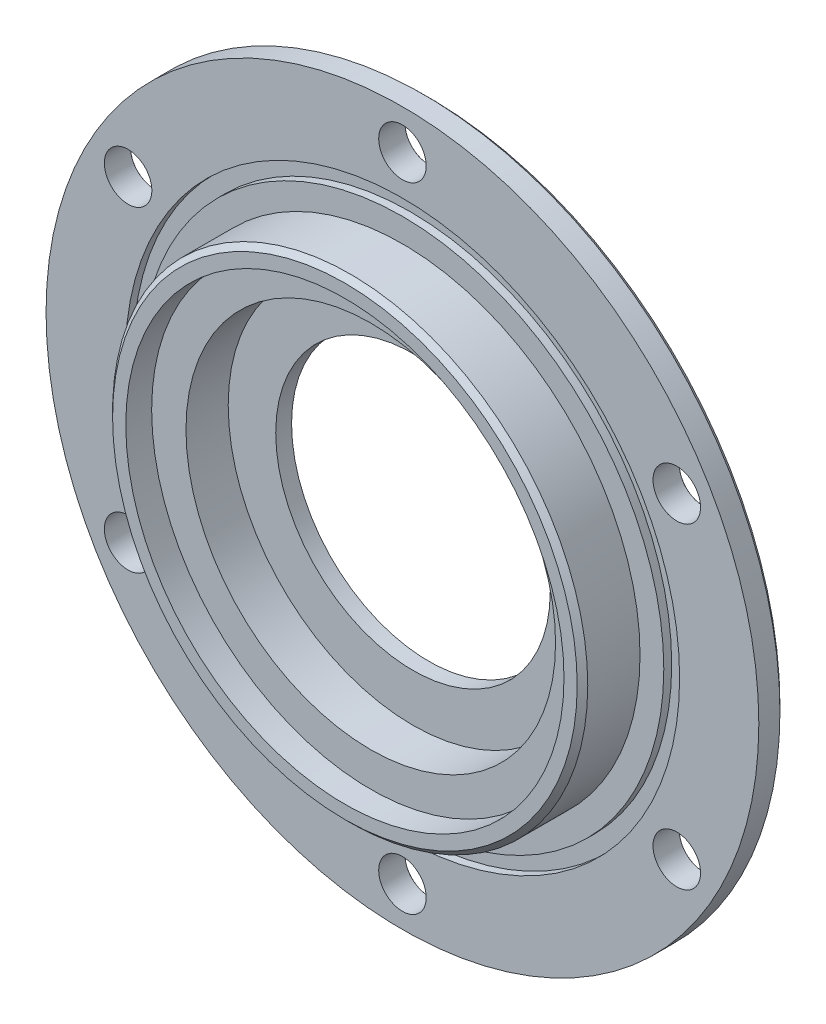
ISO-10303-21;
HEADER;
FILE_DESCRIPTION(('STEP AP214'),'2;1');
FILE_NAME('part.step','',(''),(''),'','','');
FILE_SCHEMA(('AUTOMOTIVE_DESIGN { 1 0 10303 214 1 1 1 1 }'));
ENDSEC;
DATA;
#1=APPLICATION_CONTEXT('core data for automotive mechanical design processes');
#2=APPLICATION_PROTOCOL_DEFINITION('international standard','automotive_design',2000,#1);
#3=PRODUCT_CONTEXT('',#1,'mechanical');
#4=PRODUCT('Part','Part','',(#3));
#5=PRODUCT_RELATED_PRODUCT_CATEGORY('part','',(#4));
#6=PRODUCT_DEFINITION_FORMATION('','',#4);
#7=PRODUCT_DEFINITION_CONTEXT('part definition',#1,'design');
#8=PRODUCT_DEFINITION('design','',#6,#7);
#9=PRODUCT_DEFINITION_SHAPE('','',#8);
#10=(LENGTH_UNIT() NAMED_UNIT(*) SI_UNIT(.MILLI.,.METRE.));
#11=(NAMED_UNIT(*) PLANE_ANGLE_UNIT() SI_UNIT($,.RADIAN.));
#12=(NAMED_UNIT(*) SI_UNIT($,.STERADIAN.) SOLID_ANGLE_UNIT());
#13=UNCERTAINTY_MEASURE_WITH_UNIT(LENGTH_MEASURE(1.E-05),#10,'distance_accuracy_value','');
#14=(GEOMETRIC_REPRESENTATION_CONTEXT(3) GLOBAL_UNCERTAINTY_ASSIGNED_CONTEXT((#13)) GLOBAL_UNIT_ASSIGNED_CONTEXT((#10,
#11,#12)) REPRESENTATION_CONTEXT('',''));
#15=CARTESIAN_POINT('',(0.,0.,0.));
#16=DIRECTION('',(0.,0.,1.));
#17=DIRECTION('',(1.,0.,0.));
#18=AXIS2_PLACEMENT_3D('',#15,#16,#17);
#19=CARTESIAN_POINT('',(0.,0.,11.));
#20=DIRECTION('',(0.,0.,1.));
#21=DIRECTION('',(1.,0.,0.));
#22=AXIS2_PLACEMENT_3D('',#19,#20,#21);
#23=PLANE('',#22);
#24=CARTESIAN_POINT('',(0.,0.,11.));
#25=DIRECTION('',(0.,0.,-1.));
#26=DIRECTION('',(-1.,0.,0.));
#27=AXIS2_PLACEMENT_3D('',#24,#25,#26);
#28=CIRCLE('',#27,35.);
#29=CARTESIAN_POINT('',(-35.,0.,11.));
#30=VERTEX_POINT('',#29);
#31=EDGE_CURVE('E99',#30,#30,#28,.T.);
#32=ORIENTED_EDGE('',*,*,#31,.T.);
#33=EDGE_LOOP('',(#32));
#34=FACE_BOUND('',#33,.T.);
#35=CARTESIAN_POINT('',(0.,0.,11.));
#36=DIRECTION('',(0.,0.,1.));
#37=DIRECTION('',(1.,0.,0.));
#38=AXIS2_PLACEMENT_3D('',#35,#36,#37);
#39=CIRCLE('',#38,41.5);
#40=CARTESIAN_POINT('',(41.5,0.,11.));
#41=VERTEX_POINT('',#40);
#42=EDGE_CURVE('E45',#41,#41,#39,.F.);
#43=ORIENTED_EDGE('',*,*,#42,.F.);
#44=EDGE_LOOP('',(#43));
#45=FACE_BOUND('',#44,.T.);
#46=ADVANCED_FACE('F33',(#34,#45),#23,.T.);
#47=CARTESIAN_POINT('',(0.,0.,5.));
#48=DIRECTION('',(0.,0.,1.));
#49=DIRECTION('',(1.,0.,0.));
#50=AXIS2_PLACEMENT_3D('',#47,#48,#49);
#51=PLANE('',#50);
#52=CARTESIAN_POINT('',(0.,0.,5.));
#53=DIRECTION('',(0.,0.,1.));
#54=DIRECTION('',(1.,0.,0.));
#55=AXIS2_PLACEMENT_3D('',#52,#53,#54);
#56=CIRCLE('',#55,45.);
#57=CARTESIAN_POINT('',(45.,0.,5.));
#58=VERTEX_POINT('',#57);
#59=EDGE_CURVE('E87',#58,#58,#56,.T.);
#60=ORIENTED_EDGE('',*,*,#59,.F.);
#61=EDGE_LOOP('',(#60));
#62=FACE_BOUND('',#61,.T.);
#63=CARTESIAN_POINT('',(0.,0.,5.));
#64=DIRECTION('',(0.,0.,1.));
#65=DIRECTION('',(1.,0.,0.));
#66=AXIS2_PLACEMENT_3D('',#63,#64,#65);
#67=CIRCLE('',#66,49.5);
#68=CARTESIAN_POINT('',(49.5,0.,5.));
#69=VERTEX_POINT('',#68);
#70=EDGE_CURVE('E136',#69,#69,#67,.T.);
#71=ORIENTED_EDGE('',*,*,#70,.T.);
#72=EDGE_LOOP('',(#71));
#73=FACE_BOUND('',#72,.T.);
#74=ADVANCED_FACE('F161',(#62,#73),#51,.T.);
#75=CARTESIAN_POINT('',(0.,0.,0.));
#76=DIRECTION('',(0.,0.,1.));
#77=DIRECTION('',(1.,0.,0.));
#78=AXIS2_PLACEMENT_3D('',#75,#76,#77);
#79=PLANE('',#78);
#80=CARTESIAN_POINT('',(-51.961524227066,30.0000000000006,0.));
#81=DIRECTION('',(0.,0.,-1.));
#82=DIRECTION('',(-1.,0.,0.));
#83=AXIS2_PLACEMENT_3D('',#80,#81,#82);
#84=CIRCLE('',#83,4.525);
#85=CARTESIAN_POINT('',(-56.486524227066,30.0000000000006,0.));
#86=VERTEX_POINT('',#85);
#87=EDGE_CURVE('E126',#86,#86,#84,.T.);
#88=ORIENTED_EDGE('',*,*,#87,.F.);
#89=EDGE_LOOP('',(#88));
#90=FACE_BOUND('',#89,.T.);
#91=CARTESIAN_POINT('',(-51.9615242270666,-29.9999999999995,0.));
#92=DIRECTION('',(0.,0.,-1.));
#93=DIRECTION('',(-1.,0.,0.));
#94=AXIS2_PLACEMENT_3D('',#91,#92,#93);
#95=CIRCLE('',#94,4.525);
#96=CARTESIAN_POINT('',(-56.4865242270666,-29.9999999999995,0.));
#97=VERTEX_POINT('',#96);
#98=EDGE_CURVE('E55',#97,#97,#95,.T.);
#99=ORIENTED_EDGE('',*,*,#98,.F.);
#100=EDGE_LOOP('',(#99));
#101=FACE_BOUND('',#100,.T.);
#102=CARTESIAN_POINT('',(0.,-60.,0.));
#103=DIRECTION('',(0.,0.,-1.));
#104=DIRECTION('',(-1.,0.,0.));
#105=AXIS2_PLACEMENT_3D('',#102,#103,#104);
#106=CIRCLE('',#105,4.525);
#107=CARTESIAN_POINT('',(-4.525,-60.,0.));
#108=VERTEX_POINT('',#107);
#109=EDGE_CURVE('E60',#108,#108,#106,.T.);
#110=ORIENTED_EDGE('',*,*,#109,.F.);
#111=EDGE_LOOP('',(#110));
#112=FACE_BOUND('',#111,.T.);
#113=CARTESIAN_POINT('',(51.9615242270664,29.9999999999999,0.));
#114=DIRECTION('',(0.,0.,-1.));
#115=DIRECTION('',(-1.,0.,0.));
#116=AXIS2_PLACEMENT_3D('',#113,#114,#115);
#117=CIRCLE('',#116,4.525);
#118=CARTESIAN_POINT('',(47.4365242270664,29.9999999999999,0.));
#119=VERTEX_POINT('',#118);
#120=EDGE_CURVE('E70',#119,#119,#117,.T.);
#121=ORIENTED_EDGE('',*,*,#120,.F.);
#122=EDGE_LOOP('',(#121));
#123=FACE_BOUND('',#122,.T.);
#124=CARTESIAN_POINT('',(0.,60.,0.));
#125=DIRECTION('',(0.,0.,-1.));
#126=DIRECTION('',(-1.,0.,0.));
#127=AXIS2_PLACEMENT_3D('',#124,#125,#126);
#128=CIRCLE('',#127,4.525);
#129=CARTESIAN_POINT('',(-4.525,60.,0.));
#130=VERTEX_POINT('',#129);
#131=EDGE_CURVE('E75',#130,#130,#128,.T.);
#132=ORIENTED_EDGE('',*,*,#131,.F.);
#133=EDGE_LOOP('',(#132));
#134=FACE_BOUND('',#133,.T.);
#135=CARTESIAN_POINT('',(0.,0.,0.));
#136=DIRECTION('',(0.,0.,1.));
#137=DIRECTION('',(1.,0.,0.));
#138=AXIS2_PLACEMENT_3D('',#135,#136,#137);
#139=CIRCLE('',#138,66.5);
#140=CARTESIAN_POINT('',(66.5,0.,0.));
#141=VERTEX_POINT('',#140);
#142=EDGE_CURVE('E49',#141,#141,#139,.F.);
#143=ORIENTED_EDGE('',*,*,#142,.T.);
#144=EDGE_LOOP('',(#143));
#145=FACE_BOUND('',#144,.T.);
#146=CARTESIAN_POINT('',(0.,0.,0.));
#147=DIRECTION('',(0.,0.,-1.));
#148=DIRECTION('',(-1.,0.,0.));
#149=AXIS2_PLACEMENT_3D('',#146,#147,#148);
#150=CIRCLE('',#149,26.);
#151=CARTESIAN_POINT('',(-26.,0.,0.));
#152=VERTEX_POINT('',#151);
#153=EDGE_CURVE('E91',#152,#152,#150,.T.);
#154=ORIENTED_EDGE('',*,*,#153,.F.);
#155=EDGE_LOOP('',(#154));
#156=FACE_BOUND('',#155,.T.);
#157=CARTESIAN_POINT('',(51.9615242270662,-30.0000000000002,0.));
#158=DIRECTION('',(0.,0.,-1.));
#159=DIRECTION('',(-1.,0.,0.));
#160=AXIS2_PLACEMENT_3D('',#157,#158,#159);
#161=CIRCLE('',#160,4.525);
#162=CARTESIAN_POINT('',(47.4365242270662,-30.0000000000002,0.));
#163=VERTEX_POINT('',#162);
#164=EDGE_CURVE('E65',#163,#163,#161,.T.);
#165=ORIENTED_EDGE('',*,*,#164,.F.);
#166=EDGE_LOOP('',(#165));
#167=FACE_BOUND('',#166,.T.);
#168=ADVANCED_FACE('F167',(#90,#101,#112,#123,#134,#145,#156,#167),#79,.F.);
#169=CARTESIAN_POINT('',(0.,0.,5.));
#170=DIRECTION('',(0.,0.,-1.));
#171=DIRECTION('',(-1.,0.,0.));
#172=AXIS2_PLACEMENT_3D('',#169,#170,#171);
#173=CYLINDRICAL_SURFACE('',#172,67.5);
#174=CARTESIAN_POINT('',(0.,0.,1.));
#175=DIRECTION('',(0.,0.,1.));
#176=DIRECTION('',(1.,0.,0.));
#177=AXIS2_PLACEMENT_3D('',#174,#175,#176);
#178=CIRCLE('',#177,67.5);
#179=CARTESIAN_POINT('',(67.5,0.,1.));
#180=VERTEX_POINT('',#179);
#181=EDGE_CURVE('E84',#180,#180,#178,.T.);
#182=ORIENTED_EDGE('',*,*,#181,.T.);
#183=EDGE_LOOP('',(#182));
#184=FACE_BOUND('',#183,.T.);
#185=CARTESIAN_POINT('',(0.,0.,5.));
#186=DIRECTION('',(0.,0.,1.));
#187=DIRECTION('',(1.,0.,0.));
#188=AXIS2_PLACEMENT_3D('',#185,#186,#187);
#189=CIRCLE('',#188,67.5);
#190=CARTESIAN_POINT('',(67.5,0.,5.));
#191=VERTEX_POINT('',#190);
#192=EDGE_CURVE('E88',#191,#191,#189,.T.);
#193=ORIENTED_EDGE('',*,*,#192,.F.);
#194=EDGE_LOOP('',(#193));
#195=FACE_BOUND('',#194,.T.);
#196=ADVANCED_FACE('F180',(#184,#195),#173,.T.);
#197=CARTESIAN_POINT('',(0.,0.,5.));
#198=DIRECTION('',(0.,0.,1.));
#199=DIRECTION('',(1.,0.,0.));
#200=AXIS2_PLACEMENT_3D('',#197,#198,#199);
#201=CIRCLE('',#200,52.5);
#202=CARTESIAN_POINT('',(52.5,0.,5.));
#203=VERTEX_POINT('',#202);
#204=EDGE_CURVE('E130',#203,#203,#201,.T.);
#205=ORIENTED_EDGE('',*,*,#204,.F.);
#206=EDGE_LOOP('',(#205));
#207=FACE_BOUND('',#206,.T.);
#208=CARTESIAN_POINT('',(-51.961524227066,30.0000000000006,5.));
#209=DIRECTION('',(0.,0.,1.));
#210=DIRECTION('',(1.,0.,0.));
#211=AXIS2_PLACEMENT_3D('',#208,#209,#210);
#212=CIRCLE('',#211,4.5);
#213=CARTESIAN_POINT('',(-47.461524227066,30.0000000000006,5.));
#214=VERTEX_POINT('',#213);
#215=EDGE_CURVE('E52',#214,#214,#212,.T.);
#216=ORIENTED_EDGE('',*,*,#215,.F.);
#217=EDGE_LOOP('',(#216));
#218=FACE_BOUND('',#217,.T.);
#219=CARTESIAN_POINT('',(-51.9615242270666,-29.9999999999995,5.));
#220=DIRECTION('',(0.,0.,1.));
#221=DIRECTION('',(1.,0.,0.));
#222=AXIS2_PLACEMENT_3D('',#219,#220,#221);
#223=CIRCLE('',#222,4.5);
#224=CARTESIAN_POINT('',(-47.4615242270666,-29.9999999999995,5.));
#225=VERTEX_POINT('',#224);
#226=EDGE_CURVE('E57',#225,#225,#223,.T.);
#227=ORIENTED_EDGE('',*,*,#226,.F.);
#228=EDGE_LOOP('',(#227));
#229=FACE_BOUND('',#228,.T.);
#230=CARTESIAN_POINT('',(0.,-60.,5.));
#231=DIRECTION('',(0.,0.,1.));
#232=DIRECTION('',(1.,0.,0.));
#233=AXIS2_PLACEMENT_3D('',#230,#231,#232);
#234=CIRCLE('',#233,4.5);
#235=CARTESIAN_POINT('',(4.5,-60.,5.));
#236=VERTEX_POINT('',#235);
#237=EDGE_CURVE('E62',#236,#236,#234,.T.);
#238=ORIENTED_EDGE('',*,*,#237,.F.);
#239=EDGE_LOOP('',(#238));
#240=FACE_BOUND('',#239,.T.);
#241=CARTESIAN_POINT('',(51.9615242270662,-30.0000000000002,5.));
#242=DIRECTION('',(0.,0.,1.));
#243=DIRECTION('',(1.,0.,0.));
#244=AXIS2_PLACEMENT_3D('',#241,#242,#243);
#245=CIRCLE('',#244,4.5);
#246=CARTESIAN_POINT('',(56.4615242270662,-30.0000000000002,5.));
#247=VERTEX_POINT('',#246);
#248=EDGE_CURVE('E67',#247,#247,#245,.T.);
#249=ORIENTED_EDGE('',*,*,#248,.F.);
#250=EDGE_LOOP('',(#249));
#251=FACE_BOUND('',#250,.T.);
#252=CARTESIAN_POINT('',(51.9615242270664,29.9999999999999,5.));
#253=DIRECTION('',(0.,0.,1.));
#254=DIRECTION('',(1.,0.,0.));
#255=AXIS2_PLACEMENT_3D('',#252,#253,#254);
#256=CIRCLE('',#255,4.5);
#257=CARTESIAN_POINT('',(56.4615242270664,29.9999999999999,5.));
#258=VERTEX_POINT('',#257);
#259=EDGE_CURVE('E72',#258,#258,#256,.T.);
#260=ORIENTED_EDGE('',*,*,#259,.F.);
#261=EDGE_LOOP('',(#260));
#262=FACE_BOUND('',#261,.T.);
#263=CARTESIAN_POINT('',(0.,60.,5.));
#264=DIRECTION('',(0.,0.,1.));
#265=DIRECTION('',(1.,0.,0.));
#266=AXIS2_PLACEMENT_3D('',#263,#264,#265);
#267=CIRCLE('',#266,4.5);
#268=CARTESIAN_POINT('',(4.5,60.,5.));
#269=VERTEX_POINT('',#268);
#270=EDGE_CURVE('E77',#269,#269,#267,.T.);
#271=ORIENTED_EDGE('',*,*,#270,.F.);
#272=EDGE_LOOP('',(#271));
#273=FACE_BOUND('',#272,.T.);
#274=ORIENTED_EDGE('',*,*,#192,.T.);
#275=EDGE_LOOP('',(#274));
#276=FACE_BOUND('',#275,.T.);
#277=ADVANCED_FACE('F170',(#207,#218,#229,#240,#251,#262,#273,#276),#51,.T.);
#278=CARTESIAN_POINT('',(0.,0.,11.));
#279=DIRECTION('',(0.,0.,-1.));
#280=DIRECTION('',(-1.,0.,0.));
#281=AXIS2_PLACEMENT_3D('',#278,#279,#280);
#282=CYLINDRICAL_SURFACE('',#281,45.);
#283=CARTESIAN_POINT('',(0.,0.,14.9));
#284=DIRECTION('',(0.,0.,1.));
#285=DIRECTION('',(1.,0.,0.));
#286=AXIS2_PLACEMENT_3D('',#283,#284,#285);
#287=CIRCLE('',#286,45.);
#288=CARTESIAN_POINT('',(45.,0.,14.9));
#289=VERTEX_POINT('',#288);
#290=EDGE_CURVE('E10',#289,#289,#287,.F.);
#291=ORIENTED_EDGE('',*,*,#290,.T.);
#292=EDGE_LOOP('',(#291));
#293=FACE_BOUND('',#292,.T.);
#294=ORIENTED_EDGE('',*,*,#59,.T.);
#295=EDGE_LOOP('',(#294));
#296=FACE_BOUND('',#295,.T.);
#297=ADVANCED_FACE('F176',(#293,#296),#282,.T.);
#298=CARTESIAN_POINT('',(0.,0.,3.));
#299=DIRECTION('',(0.,0.,-1.));
#300=DIRECTION('',(-1.,0.,0.));
#301=AXIS2_PLACEMENT_3D('',#298,#299,#300);
#302=CYLINDRICAL_SURFACE('',#301,26.);
#303=CARTESIAN_POINT('',(0.,0.,3.));
#304=DIRECTION('',(0.,0.,-1.));
#305=DIRECTION('',(-1.,0.,0.));
#306=AXIS2_PLACEMENT_3D('',#303,#304,#305);
#307=CIRCLE('',#306,26.);
#308=CARTESIAN_POINT('',(-26.,0.,3.));
#309=VERTEX_POINT('',#308);
#310=EDGE_CURVE('E96',#309,#309,#307,.T.);
#311=ORIENTED_EDGE('',*,*,#310,.F.);
#312=EDGE_LOOP('',(#311));
#313=FACE_BOUND('',#312,.T.);
#314=ORIENTED_EDGE('',*,*,#153,.T.);
#315=EDGE_LOOP('',(#314));
#316=FACE_BOUND('',#315,.T.);
#317=ADVANCED_FACE('F174',(#313,#316),#302,.F.);
#318=CARTESIAN_POINT('',(0.,0.,11.));
#319=DIRECTION('',(0.,0.,-1.));
#320=DIRECTION('',(-1.,0.,0.));
#321=AXIS2_PLACEMENT_3D('',#318,#319,#320);
#322=CYLINDRICAL_SURFACE('',#321,35.);
#323=ORIENTED_EDGE('',*,*,#31,.F.);
#324=EDGE_LOOP('',(#323));
#325=FACE_BOUND('',#324,.T.);
#326=CARTESIAN_POINT('',(0.,0.,3.));
#327=DIRECTION('',(0.,0.,-1.));
#328=DIRECTION('',(-1.,0.,0.));
#329=AXIS2_PLACEMENT_3D('',#326,#327,#328);
#330=CIRCLE('',#329,35.);
#331=CARTESIAN_POINT('',(-35.,0.,3.));
#332=VERTEX_POINT('',#331);
#333=EDGE_CURVE('E80',#332,#332,#330,.T.);
#334=ORIENTED_EDGE('',*,*,#333,.T.);
#335=EDGE_LOOP('',(#334));
#336=FACE_BOUND('',#335,.T.);
#337=ADVANCED_FACE('F202',(#325,#336),#322,.F.);
#338=CARTESIAN_POINT('',(0.,0.,3.));
#339=DIRECTION('',(0.,0.,-1.));
#340=DIRECTION('',(-1.,0.,0.));
#341=AXIS2_PLACEMENT_3D('',#338,#339,#340);
#342=PLANE('',#341);
#343=ORIENTED_EDGE('',*,*,#310,.T.);
#344=EDGE_LOOP('',(#343));
#345=FACE_BOUND('',#344,.T.);
#346=ORIENTED_EDGE('',*,*,#333,.F.);
#347=EDGE_LOOP('',(#346));
#348=FACE_BOUND('',#347,.T.);
#349=ADVANCED_FACE('F193',(#345,#348),#342,.F.);
#350=CARTESIAN_POINT('',(0.,0.,1.));
#351=DIRECTION('',(0.,0.,1.));
#352=DIRECTION('',(1.,0.,0.));
#353=AXIS2_PLACEMENT_3D('',#350,#351,#352);
#354=CONICAL_SURFACE('',#353,67.5,0.785398163397448);
#355=ORIENTED_EDGE('',*,*,#142,.F.);
#356=EDGE_LOOP('',(#355));
#357=FACE_BOUND('',#356,.T.);
#358=ORIENTED_EDGE('',*,*,#181,.F.);
#359=EDGE_LOOP('',(#358));
#360=FACE_BOUND('',#359,.T.);
#361=ADVANCED_FACE('F188',(#357,#360),#354,.T.);
#362=CARTESIAN_POINT('',(0.,60.,0.));
#363=DIRECTION('',(0.,0.,-1.));
#364=DIRECTION('',(-1.,0.,0.));
#365=AXIS2_PLACEMENT_3D('',#362,#363,#364);
#366=CYLINDRICAL_SURFACE('',#365,4.5);
#367=ORIENTED_EDGE('',*,*,#270,.T.);
#368=EDGE_LOOP('',(#367));
#369=FACE_BOUND('',#368,.T.);
#370=CARTESIAN_POINT('',(0.,60.,0.0249999999999972));
#371=DIRECTION('',(0.,0.,-1.));
#372=DIRECTION('',(-1.,0.,0.));
#373=AXIS2_PLACEMENT_3D('',#370,#371,#372);
#374=CIRCLE('',#373,4.5);
#375=CARTESIAN_POINT('',(-4.5,60.,0.0249999999999972));
#376=VERTEX_POINT('',#375);
#377=EDGE_CURVE('E81',#376,#376,#374,.T.);
#378=ORIENTED_EDGE('',*,*,#377,.T.);
#379=EDGE_LOOP('',(#378));
#380=FACE_BOUND('',#379,.T.);
#381=ADVANCED_FACE('F192',(#369,#380),#366,.F.);
#382=CARTESIAN_POINT('',(0.,60.,0.));
#383=DIRECTION('',(0.,0.,-1.));
#384=DIRECTION('',(-1.,0.,0.));
#385=AXIS2_PLACEMENT_3D('',#382,#383,#384);
#386=CONICAL_SURFACE('',#385,4.525,0.785398163397535);
#387=ORIENTED_EDGE('',*,*,#377,.F.);
#388=EDGE_LOOP('',(#387));
#389=FACE_BOUND('',#388,.T.);
#390=ORIENTED_EDGE('',*,*,#131,.T.);
#391=EDGE_LOOP('',(#390));
#392=FACE_BOUND('',#391,.T.);
#393=ADVANCED_FACE('F199',(#389,#392),#386,.F.);
#394=CARTESIAN_POINT('',(51.9615242270664,29.9999999999999,0.));
#395=DIRECTION('',(0.,0.,-1.));
#396=DIRECTION('',(-1.,0.,0.));
#397=AXIS2_PLACEMENT_3D('',#394,#395,#396);
#398=CYLINDRICAL_SURFACE('',#397,4.5);
#399=ORIENTED_EDGE('',*,*,#259,.T.);
#400=EDGE_LOOP('',(#399));
#401=FACE_BOUND('',#400,.T.);
#402=CARTESIAN_POINT('',(51.9615242270664,29.9999999999999,0.0249999999999972));
#403=DIRECTION('',(0.,0.,-1.));
#404=DIRECTION('',(-1.,0.,0.));
#405=AXIS2_PLACEMENT_3D('',#402,#403,#404);
#406=CIRCLE('',#405,4.5);
#407=CARTESIAN_POINT('',(47.4615242270664,29.9999999999999,0.0249999999999972));
#408=VERTEX_POINT('',#407);
#409=EDGE_CURVE('E76',#408,#408,#406,.T.);
#410=ORIENTED_EDGE('',*,*,#409,.T.);
#411=EDGE_LOOP('',(#410));
#412=FACE_BOUND('',#411,.T.);
#413=ADVANCED_FACE('F238',(#401,#412),#398,.F.);
#414=CARTESIAN_POINT('',(51.9615242270664,29.9999999999999,0.));
#415=DIRECTION('',(0.,0.,-1.));
#416=DIRECTION('',(-1.,0.,0.));
#417=AXIS2_PLACEMENT_3D('',#414,#415,#416);
#418=CONICAL_SURFACE('',#417,4.525,0.785398163397552);
#419=ORIENTED_EDGE('',*,*,#409,.F.);
#420=EDGE_LOOP('',(#419));
#421=FACE_BOUND('',#420,.T.);
#422=ORIENTED_EDGE('',*,*,#120,.T.);
#423=EDGE_LOOP('',(#422));
#424=FACE_BOUND('',#423,.T.);
#425=ADVANCED_FACE('F230',(#421,#424),#418,.F.);
#426=CARTESIAN_POINT('',(51.9615242270662,-30.0000000000002,0.));
#427=DIRECTION('',(0.,0.,-1.));
#428=DIRECTION('',(-1.,0.,0.));
#429=AXIS2_PLACEMENT_3D('',#426,#427,#428);
#430=CYLINDRICAL_SURFACE('',#429,4.5);
#431=ORIENTED_EDGE('',*,*,#248,.T.);
#432=EDGE_LOOP('',(#431));
#433=FACE_BOUND('',#432,.T.);
#434=CARTESIAN_POINT('',(51.9615242270662,-30.0000000000002,0.0249999999999972));
#435=DIRECTION('',(0.,0.,-1.));
#436=DIRECTION('',(-1.,0.,0.));
#437=AXIS2_PLACEMENT_3D('',#434,#435,#436);
#438=CIRCLE('',#437,4.5);
#439=CARTESIAN_POINT('',(47.4615242270662,-30.0000000000002,0.0249999999999972));
#440=VERTEX_POINT('',#439);
#441=EDGE_CURVE('E71',#440,#440,#438,.T.);
#442=ORIENTED_EDGE('',*,*,#441,.T.);
#443=EDGE_LOOP('',(#442));
#444=FACE_BOUND('',#443,.T.);
#445=ADVANCED_FACE('F220',(#433,#444),#430,.F.);
#446=CARTESIAN_POINT('',(51.9615242270662,-30.0000000000002,0.));
#447=DIRECTION('',(0.,0.,-1.));
#448=DIRECTION('',(-1.,0.,0.));
#449=AXIS2_PLACEMENT_3D('',#446,#447,#448);
#450=CONICAL_SURFACE('',#449,4.525,0.785398163397552);
#451=ORIENTED_EDGE('',*,*,#441,.F.);
#452=EDGE_LOOP('',(#451));
#453=FACE_BOUND('',#452,.T.);
#454=ORIENTED_EDGE('',*,*,#164,.T.);
#455=EDGE_LOOP('',(#454));
#456=FACE_BOUND('',#455,.T.);
#457=ADVANCED_FACE('F217',(#453,#456),#450,.F.);
#458=CARTESIAN_POINT('',(0.,-60.,0.));
#459=DIRECTION('',(0.,0.,-1.));
#460=DIRECTION('',(-1.,0.,0.));
#461=AXIS2_PLACEMENT_3D('',#458,#459,#460);
#462=CYLINDRICAL_SURFACE('',#461,4.5);
#463=ORIENTED_EDGE('',*,*,#237,.T.);
#464=EDGE_LOOP('',(#463));
#465=FACE_BOUND('',#464,.T.);
#466=CARTESIAN_POINT('',(0.,-60.,0.0249999999999972));
#467=DIRECTION('',(0.,0.,-1.));
#468=DIRECTION('',(-1.,0.,0.));
#469=AXIS2_PLACEMENT_3D('',#466,#467,#468);
#470=CIRCLE('',#469,4.5);
#471=CARTESIAN_POINT('',(-4.5,-60.,0.0249999999999972));
#472=VERTEX_POINT('',#471);
#473=EDGE_CURVE('E66',#472,#472,#470,.T.);
#474=ORIENTED_EDGE('',*,*,#473,.T.);
#475=EDGE_LOOP('',(#474));
#476=FACE_BOUND('',#475,.T.);
#477=ADVANCED_FACE('F219',(#465,#476),#462,.F.);
#478=CARTESIAN_POINT('',(0.,-60.,0.));
#479=DIRECTION('',(0.,0.,-1.));
#480=DIRECTION('',(-1.,0.,0.));
#481=AXIS2_PLACEMENT_3D('',#478,#479,#480);
#482=CONICAL_SURFACE('',#481,4.525,0.785398163397535);
#483=ORIENTED_EDGE('',*,*,#473,.F.);
#484=EDGE_LOOP('',(#483));
#485=FACE_BOUND('',#484,.T.);
#486=ORIENTED_EDGE('',*,*,#109,.T.);
#487=EDGE_LOOP('',(#486));
#488=FACE_BOUND('',#487,.T.);
#489=ADVANCED_FACE('F227',(#485,#488),#482,.F.);
#490=CARTESIAN_POINT('',(-51.9615242270666,-29.9999999999995,0.));
#491=DIRECTION('',(0.,0.,-1.));
#492=DIRECTION('',(-1.,0.,0.));
#493=AXIS2_PLACEMENT_3D('',#490,#491,#492);
#494=CYLINDRICAL_SURFACE('',#493,4.5);
#495=ORIENTED_EDGE('',*,*,#226,.T.);
#496=EDGE_LOOP('',(#495));
#497=FACE_BOUND('',#496,.T.);
#498=CARTESIAN_POINT('',(-51.9615242270666,-29.9999999999995,0.0249999999999972));
#499=DIRECTION('',(0.,0.,-1.));
#500=DIRECTION('',(-1.,0.,0.));
#501=AXIS2_PLACEMENT_3D('',#498,#499,#500);
#502=CIRCLE('',#501,4.5);
#503=CARTESIAN_POINT('',(-56.4615242270666,-29.9999999999995,0.0249999999999972));
#504=VERTEX_POINT('',#503);
#505=EDGE_CURVE('E61',#504,#504,#502,.T.);
#506=ORIENTED_EDGE('',*,*,#505,.T.);
#507=EDGE_LOOP('',(#506));
#508=FACE_BOUND('',#507,.T.);
#509=ADVANCED_FACE('F317',(#497,#508),#494,.F.);
#510=CARTESIAN_POINT('',(-51.9615242270666,-29.9999999999995,0.));
#511=DIRECTION('',(0.,0.,-1.));
#512=DIRECTION('',(-1.,0.,0.));
#513=AXIS2_PLACEMENT_3D('',#510,#511,#512);
#514=CONICAL_SURFACE('',#513,4.525,0.785398163397552);
#515=ORIENTED_EDGE('',*,*,#505,.F.);
#516=EDGE_LOOP('',(#515));
#517=FACE_BOUND('',#516,.T.);
#518=ORIENTED_EDGE('',*,*,#98,.T.);
#519=EDGE_LOOP('',(#518));
#520=FACE_BOUND('',#519,.T.);
#521=ADVANCED_FACE('F307',(#517,#520),#514,.F.);
#522=CARTESIAN_POINT('',(-51.961524227066,30.0000000000006,0.));
#523=DIRECTION('',(0.,0.,-1.));
#524=DIRECTION('',(-1.,0.,0.));
#525=AXIS2_PLACEMENT_3D('',#522,#523,#524);
#526=CYLINDRICAL_SURFACE('',#525,4.5);
#527=ORIENTED_EDGE('',*,*,#215,.T.);
#528=EDGE_LOOP('',(#527));
#529=FACE_BOUND('',#528,.T.);
#530=CARTESIAN_POINT('',(-51.961524227066,30.0000000000006,0.0249999999999972));
#531=DIRECTION('',(0.,0.,-1.));
#532=DIRECTION('',(-1.,0.,0.));
#533=AXIS2_PLACEMENT_3D('',#530,#531,#532);
#534=CIRCLE('',#533,4.5);
#535=CARTESIAN_POINT('',(-56.461524227066,30.0000000000006,0.0249999999999972));
#536=VERTEX_POINT('',#535);
#537=EDGE_CURVE('E56',#536,#536,#534,.T.);
#538=ORIENTED_EDGE('',*,*,#537,.T.);
#539=EDGE_LOOP('',(#538));
#540=FACE_BOUND('',#539,.T.);
#541=ADVANCED_FACE('F296',(#529,#540),#526,.F.);
#542=CARTESIAN_POINT('',(-51.961524227066,30.0000000000006,0.));
#543=DIRECTION('',(0.,0.,-1.));
#544=DIRECTION('',(-1.,0.,0.));
#545=AXIS2_PLACEMENT_3D('',#542,#543,#544);
#546=CONICAL_SURFACE('',#545,4.525,0.785398163397552);
#547=ORIENTED_EDGE('',*,*,#537,.F.);
#548=EDGE_LOOP('',(#547));
#549=FACE_BOUND('',#548,.T.);
#550=ORIENTED_EDGE('',*,*,#87,.T.);
#551=EDGE_LOOP('',(#550));
#552=FACE_BOUND('',#551,.T.);
#553=ADVANCED_FACE('F291',(#549,#552),#546,.F.);
#554=CARTESIAN_POINT('',(0.,0.,3.5));
#555=DIRECTION('',(0.,0.,1.));
#556=DIRECTION('',(1.,0.,0.));
#557=AXIS2_PLACEMENT_3D('',#554,#555,#556);
#558=CYLINDRICAL_SURFACE('',#557,52.5);
#559=CARTESIAN_POINT('',(0.,0.,3.5));
#560=DIRECTION('',(0.,0.,1.));
#561=DIRECTION('',(1.,0.,0.));
#562=AXIS2_PLACEMENT_3D('',#559,#560,#561);
#563=CIRCLE('',#562,52.5);
#564=CARTESIAN_POINT('',(52.5,0.,3.5));
#565=VERTEX_POINT('',#564);
#566=EDGE_CURVE('E129',#565,#565,#563,.T.);
#567=ORIENTED_EDGE('',*,*,#566,.F.);
#568=EDGE_LOOP('',(#567));
#569=FACE_BOUND('',#568,.T.);
#570=ORIENTED_EDGE('',*,*,#204,.T.);
#571=EDGE_LOOP('',(#570));
#572=FACE_BOUND('',#571,.T.);
#573=ADVANCED_FACE('F295',(#569,#572),#558,.F.);
#574=CARTESIAN_POINT('',(0.,0.,3.5));
#575=DIRECTION('',(0.,0.,1.));
#576=DIRECTION('',(1.,0.,0.));
#577=AXIS2_PLACEMENT_3D('',#574,#575,#576);
#578=PLANE('',#577);
#579=CARTESIAN_POINT('',(0.,0.,3.5));
#580=DIRECTION('',(0.,0.,1.));
#581=DIRECTION('',(1.,0.,0.));
#582=AXIS2_PLACEMENT_3D('',#579,#580,#581);
#583=CIRCLE('',#582,49.5);
#584=CARTESIAN_POINT('',(49.5,0.,3.5));
#585=VERTEX_POINT('',#584);
#586=EDGE_CURVE('E133',#585,#585,#583,.T.);
#587=ORIENTED_EDGE('',*,*,#586,.F.);
#588=EDGE_LOOP('',(#587));
#589=FACE_BOUND('',#588,.T.);
#590=ORIENTED_EDGE('',*,*,#566,.T.);
#591=EDGE_LOOP('',(#590));
#592=FACE_BOUND('',#591,.T.);
#593=ADVANCED_FACE('F157',(#589,#592),#578,.T.);
#594=CARTESIAN_POINT('',(0.,0.,3.5));
#595=DIRECTION('',(0.,0.,1.));
#596=DIRECTION('',(1.,0.,0.));
#597=AXIS2_PLACEMENT_3D('',#594,#595,#596);
#598=CYLINDRICAL_SURFACE('',#597,49.5);
#599=ORIENTED_EDGE('',*,*,#586,.T.);
#600=EDGE_LOOP('',(#599));
#601=FACE_BOUND('',#600,.T.);
#602=ORIENTED_EDGE('',*,*,#70,.F.);
#603=EDGE_LOOP('',(#602));
#604=FACE_BOUND('',#603,.T.);
#605=ADVANCED_FACE('F150',(#601,#604),#598,.T.);
#606=CARTESIAN_POINT('',(0.,0.,15.9));
#607=DIRECTION('',(0.,0.,1.));
#608=DIRECTION('',(1.,0.,0.));
#609=AXIS2_PLACEMENT_3D('',#606,#607,#608);
#610=PLANE('',#609);
#611=CARTESIAN_POINT('',(0.,0.,15.9));
#612=DIRECTION('',(0.,0.,1.));
#613=DIRECTION('',(1.,0.,0.));
#614=AXIS2_PLACEMENT_3D('',#611,#612,#613);
#615=CIRCLE('',#614,44.);
#616=CARTESIAN_POINT('',(44.,0.,15.9));
#617=VERTEX_POINT('',#616);
#618=EDGE_CURVE('E41',#617,#617,#615,.T.);
#619=ORIENTED_EDGE('',*,*,#618,.T.);
#620=EDGE_LOOP('',(#619));
#621=FACE_BOUND('',#620,.T.);
#622=CARTESIAN_POINT('',(0.,0.,15.9));
#623=DIRECTION('',(0.,0.,1.));
#624=DIRECTION('',(1.,0.,0.));
#625=AXIS2_PLACEMENT_3D('',#622,#623,#624);
#626=CIRCLE('',#625,41.5);
#627=CARTESIAN_POINT('',(41.5,0.,15.9));
#628=VERTEX_POINT('',#627);
#629=EDGE_CURVE('E139',#628,#628,#626,.T.);
#630=ORIENTED_EDGE('',*,*,#629,.F.);
#631=EDGE_LOOP('',(#630));
#632=FACE_BOUND('',#631,.T.);
#633=ADVANCED_FACE('F148',(#621,#632),#610,.T.);
#634=CARTESIAN_POINT('',(0.,0.,15.9));
#635=DIRECTION('',(0.,0.,-1.));
#636=DIRECTION('',(-1.,0.,0.));
#637=AXIS2_PLACEMENT_3D('',#634,#635,#636);
#638=CYLINDRICAL_SURFACE('',#637,41.5);
#639=ORIENTED_EDGE('',*,*,#629,.T.);
#640=EDGE_LOOP('',(#639));
#641=FACE_BOUND('',#640,.T.);
#642=ORIENTED_EDGE('',*,*,#42,.T.);
#643=EDGE_LOOP('',(#642));
#644=FACE_BOUND('',#643,.T.);
#645=ADVANCED_FACE('F145',(#641,#644),#638,.F.);
#646=CARTESIAN_POINT('',(0.,0.,15.9));
#647=DIRECTION('',(0.,0.,-1.));
#648=DIRECTION('',(-1.,0.,0.));
#649=AXIS2_PLACEMENT_3D('',#646,#647,#648);
#650=CONICAL_SURFACE('',#649,44.,0.785398163397434);
#651=ORIENTED_EDGE('',*,*,#290,.F.);
#652=EDGE_LOOP('',(#651));
#653=FACE_BOUND('',#652,.T.);
#654=ORIENTED_EDGE('',*,*,#618,.F.);
#655=EDGE_LOOP('',(#654));
#656=FACE_BOUND('',#655,.T.);
#657=ADVANCED_FACE('F36',(#653,#656),#650,.T.);
#658=CLOSED_SHELL('',(#46,#74,#168,#196,#277,#297,#317,#337,#349,#361,#381,#393,#413,#425,#445,
#457,#477,#489,#509,#521,#541,#553,#573,#593,#605,#633,#645,#657));
#659=MANIFOLD_SOLID_BREP('B2',#658);
#660=ADVANCED_BREP_SHAPE_REPRESENTATION('',(#18,#659),#14);
#661=SHAPE_DEFINITION_REPRESENTATION(#9,#660);
ENDSEC;
END-ISO-10303-21;
